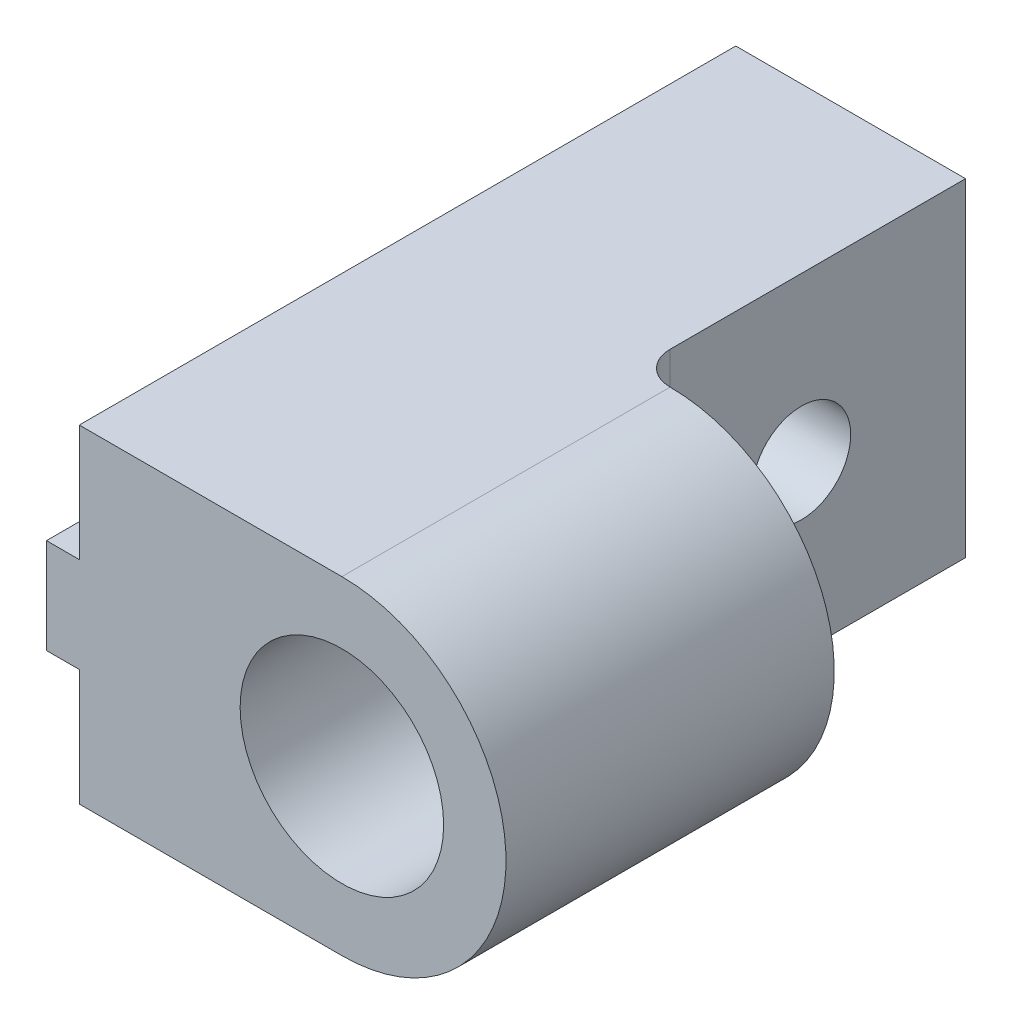
ISO-10303-21;
HEADER;
FILE_DESCRIPTION(('STEP AP214'),'2;1');
FILE_NAME('part.step','',(''),(''),'','','');
FILE_SCHEMA(('AUTOMOTIVE_DESIGN { 1 0 10303 214 1 1 1 1 }'));
ENDSEC;
DATA;
#1=APPLICATION_CONTEXT('core data for automotive mechanical design processes');
#2=APPLICATION_PROTOCOL_DEFINITION('international standard','automotive_design',2000,#1);
#3=PRODUCT_CONTEXT('',#1,'mechanical');
#4=PRODUCT('Part','Part','',(#3));
#5=PRODUCT_RELATED_PRODUCT_CATEGORY('part','',(#4));
#6=PRODUCT_DEFINITION_FORMATION('','',#4);
#7=PRODUCT_DEFINITION_CONTEXT('part definition',#1,'design');
#8=PRODUCT_DEFINITION('design','',#6,#7);
#9=PRODUCT_DEFINITION_SHAPE('','',#8);
#10=(LENGTH_UNIT() NAMED_UNIT(*) SI_UNIT(.MILLI.,.METRE.));
#11=(NAMED_UNIT(*) PLANE_ANGLE_UNIT() SI_UNIT($,.RADIAN.));
#12=(NAMED_UNIT(*) SI_UNIT($,.STERADIAN.) SOLID_ANGLE_UNIT());
#13=UNCERTAINTY_MEASURE_WITH_UNIT(LENGTH_MEASURE(1.E-05),#10,'distance_accuracy_value','');
#14=(GEOMETRIC_REPRESENTATION_CONTEXT(3) GLOBAL_UNCERTAINTY_ASSIGNED_CONTEXT((#13)) GLOBAL_UNIT_ASSIGNED_CONTEXT((#10,
#11,#12)) REPRESENTATION_CONTEXT('',''));
#15=CARTESIAN_POINT('',(0.,0.,0.));
#16=DIRECTION('',(0.,0.,1.));
#17=DIRECTION('',(1.,0.,0.));
#18=AXIS2_PLACEMENT_3D('',#15,#16,#17);
#19=CARTESIAN_POINT('',(-8.,1.45,20.));
#20=DIRECTION('',(0.,-1.,0.));
#21=DIRECTION('',(1.,0.,0.));
#22=AXIS2_PLACEMENT_3D('',#19,#20,#21);
#23=PLANE('',#22);
#24=DIRECTION('',(0.,0.,-1.));
#25=VECTOR('',#24,1.);
#26=CARTESIAN_POINT('',(-9.,1.45,20.));
#27=LINE('',#26,#25);
#28=CARTESIAN_POINT('',(-9.,1.45,4.61594271260656));
#29=VERTEX_POINT('',#28);
#30=CARTESIAN_POINT('',(-9.,1.45,0.));
#31=VERTEX_POINT('',#30);
#32=EDGE_CURVE('E151',#29,#31,#27,.T.);
#33=ORIENTED_EDGE('',*,*,#32,.F.);
#34=DIRECTION('',(1.,0.,0.));
#35=VECTOR('',#34,1.);
#36=CARTESIAN_POINT('',(-9.,1.45,4.61594271260656));
#37=LINE('',#36,#35);
#38=CARTESIAN_POINT('',(-8.,1.45,4.61594271260655));
#39=VERTEX_POINT('',#38);
#40=EDGE_CURVE('E135',#29,#39,#37,.T.);
#41=ORIENTED_EDGE('',*,*,#40,.T.);
#42=DIRECTION('',(0.,0.,-1.));
#43=VECTOR('',#42,1.);
#44=CARTESIAN_POINT('',(-8.,1.45,20.));
#45=LINE('',#44,#43);
#46=CARTESIAN_POINT('',(-8.,1.45,0.));
#47=VERTEX_POINT('',#46);
#48=EDGE_CURVE('E164',#39,#47,#45,.T.);
#49=ORIENTED_EDGE('',*,*,#48,.T.);
#50=DIRECTION('',(-1.,0.,0.));
#51=VECTOR('',#50,1.);
#52=CARTESIAN_POINT('',(-8.,1.45,0.));
#53=LINE('',#52,#51);
#54=EDGE_CURVE('E158',#47,#31,#53,.T.);
#55=ORIENTED_EDGE('',*,*,#54,.T.);
#56=EDGE_LOOP('',(#33,#41,#49,#55));
#57=FACE_BOUND('',#56,.T.);
#58=ADVANCED_FACE('F35',(#57),#23,.F.);
#59=CARTESIAN_POINT('',(-9.,1.45,20.));
#60=DIRECTION('',(1.,0.,0.));
#61=DIRECTION('',(0.,0.,-1.));
#62=AXIS2_PLACEMENT_3D('',#59,#60,#61);
#63=PLANE('',#62);
#64=CARTESIAN_POINT('',(-9.,1.45,20.));
#65=VERTEX_POINT('',#64);
#66=CARTESIAN_POINT('',(-9.,1.45,5.38405728739344));
#67=VERTEX_POINT('',#66);
#68=EDGE_CURVE('E160',#65,#67,#27,.T.);
#69=ORIENTED_EDGE('',*,*,#68,.T.);
#70=CARTESIAN_POINT('',(-9.,0.,5.));
#71=DIRECTION('',(1.,0.,0.));
#72=DIRECTION('',(0.,0.,-1.));
#73=AXIS2_PLACEMENT_3D('',#70,#71,#72);
#74=CIRCLE('',#73,1.5);
#75=CARTESIAN_POINT('',(-9.,-1.45,5.38405728739343));
#76=VERTEX_POINT('',#75);
#77=EDGE_CURVE('E154',#67,#76,#74,.T.);
#78=ORIENTED_EDGE('',*,*,#77,.T.);
#79=DIRECTION('',(0.,0.,-1.));
#80=VECTOR('',#79,1.);
#81=CARTESIAN_POINT('',(-9.,-1.45,20.));
#82=LINE('',#81,#80);
#83=CARTESIAN_POINT('',(-9.,-1.45,20.));
#84=VERTEX_POINT('',#83);
#85=EDGE_CURVE('E161',#84,#76,#82,.T.);
#86=ORIENTED_EDGE('',*,*,#85,.F.);
#87=DIRECTION('',(0.,-1.,0.));
#88=VECTOR('',#87,1.);
#89=CARTESIAN_POINT('',(-9.,1.45,20.));
#90=LINE('',#89,#88);
#91=EDGE_CURVE('E225',#65,#84,#90,.T.);
#92=ORIENTED_EDGE('',*,*,#91,.F.);
#93=EDGE_LOOP('',(#69,#78,#86,#92));
#94=FACE_BOUND('',#93,.T.);
#95=ADVANCED_FACE('F302',(#94),#63,.F.);
#96=CARTESIAN_POINT('',(-9.,-1.45,20.));
#97=DIRECTION('',(0.,1.,0.));
#98=DIRECTION('',(-1.,0.,0.));
#99=AXIS2_PLACEMENT_3D('',#96,#97,#98);
#100=PLANE('',#99);
#101=ORIENTED_EDGE('',*,*,#85,.T.);
#102=DIRECTION('',(1.,0.,0.));
#103=VECTOR('',#102,1.);
#104=CARTESIAN_POINT('',(-9.,-1.45,5.38405728739343));
#105=LINE('',#104,#103);
#106=CARTESIAN_POINT('',(-8.,-1.45,5.38405728739343));
#107=VERTEX_POINT('',#106);
#108=EDGE_CURVE('E275',#76,#107,#105,.T.);
#109=ORIENTED_EDGE('',*,*,#108,.T.);
#110=DIRECTION('',(0.,0.,-1.));
#111=VECTOR('',#110,1.);
#112=CARTESIAN_POINT('',(-8.,-1.45,20.));
#113=LINE('',#112,#111);
#114=CARTESIAN_POINT('',(-8.,-1.45,20.));
#115=VERTEX_POINT('',#114);
#116=EDGE_CURVE('E250',#115,#107,#113,.T.);
#117=ORIENTED_EDGE('',*,*,#116,.F.);
#118=DIRECTION('',(1.,0.,0.));
#119=VECTOR('',#118,1.);
#120=CARTESIAN_POINT('',(-9.,-1.45,20.));
#121=LINE('',#120,#119);
#122=EDGE_CURVE('E227',#84,#115,#121,.T.);
#123=ORIENTED_EDGE('',*,*,#122,.F.);
#124=EDGE_LOOP('',(#101,#109,#117,#123));
#125=FACE_BOUND('',#124,.T.);
#126=ADVANCED_FACE('F274',(#125),#100,.F.);
#127=CARTESIAN_POINT('',(-8.,5.,20.));
#128=DIRECTION('',(0.,-1.,0.));
#129=DIRECTION('',(0.,0.,-1.));
#130=AXIS2_PLACEMENT_3D('',#127,#128,#129);
#131=PLANE('',#130);
#132=DIRECTION('',(0.,0.,-1.));
#133=VECTOR('',#132,1.);
#134=CARTESIAN_POINT('',(0.,5.,20.));
#135=LINE('',#134,#133);
#136=CARTESIAN_POINT('',(0.,5.,20.));
#137=VERTEX_POINT('',#136);
#138=CARTESIAN_POINT('',(0.,5.,10.));
#139=VERTEX_POINT('',#138);
#140=EDGE_CURVE('E198',#137,#139,#135,.T.);
#141=ORIENTED_EDGE('',*,*,#140,.T.);
#142=CARTESIAN_POINT('',(0.,5.,9.));
#143=DIRECTION('',(0.,-1.,0.));
#144=DIRECTION('',(0.,0.,-1.));
#145=AXIS2_PLACEMENT_3D('',#142,#143,#144);
#146=CIRCLE('',#145,1.);
#147=CARTESIAN_POINT('',(-0.999999999999997,5.,9.));
#148=VERTEX_POINT('',#147);
#149=EDGE_CURVE('E11',#139,#148,#146,.T.);
#150=ORIENTED_EDGE('',*,*,#149,.T.);
#151=DIRECTION('',(0.,0.,1.));
#152=VECTOR('',#151,1.);
#153=CARTESIAN_POINT('',(-0.999999999999997,5.,10.));
#154=LINE('',#153,#152);
#155=CARTESIAN_POINT('',(-0.999999999999997,5.,0.));
#156=VERTEX_POINT('',#155);
#157=EDGE_CURVE('E203',#156,#148,#154,.T.);
#158=ORIENTED_EDGE('',*,*,#157,.F.);
#159=DIRECTION('',(-1.,0.,0.));
#160=VECTOR('',#159,1.);
#161=CARTESIAN_POINT('',(-8.,5.,0.));
#162=LINE('',#161,#160);
#163=CARTESIAN_POINT('',(-8.,5.,0.));
#164=VERTEX_POINT('',#163);
#165=EDGE_CURVE('E215',#156,#164,#162,.T.);
#166=ORIENTED_EDGE('',*,*,#165,.T.);
#167=DIRECTION('',(0.,0.,-1.));
#168=VECTOR('',#167,1.);
#169=CARTESIAN_POINT('',(-8.,5.,20.));
#170=LINE('',#169,#168);
#171=CARTESIAN_POINT('',(-8.,5.,20.));
#172=VERTEX_POINT('',#171);
#173=EDGE_CURVE('E172',#172,#164,#170,.T.);
#174=ORIENTED_EDGE('',*,*,#173,.F.);
#175=DIRECTION('',(-1.,0.,0.));
#176=VECTOR('',#175,1.);
#177=CARTESIAN_POINT('',(-8.,5.,20.));
#178=LINE('',#177,#176);
#179=EDGE_CURVE('E217',#137,#172,#178,.T.);
#180=ORIENTED_EDGE('',*,*,#179,.F.);
#181=EDGE_LOOP('',(#141,#150,#158,#166,#174,#180));
#182=FACE_BOUND('',#181,.T.);
#183=ADVANCED_FACE('F295',(#182),#131,.F.);
#184=CARTESIAN_POINT('',(-8.,-5.,20.));
#185=DIRECTION('',(0.,1.,0.));
#186=DIRECTION('',(0.,0.,1.));
#187=AXIS2_PLACEMENT_3D('',#184,#185,#186);
#188=PLANE('',#187);
#189=DIRECTION('',(0.,0.,-1.));
#190=VECTOR('',#189,1.);
#191=CARTESIAN_POINT('',(-1.,-5.,10.));
#192=LINE('',#191,#190);
#193=CARTESIAN_POINT('',(-1.,-5.,9.));
#194=VERTEX_POINT('',#193);
#195=CARTESIAN_POINT('',(-0.999999999999999,-5.,0.));
#196=VERTEX_POINT('',#195);
#197=EDGE_CURVE('E145',#194,#196,#192,.T.);
#198=ORIENTED_EDGE('',*,*,#197,.F.);
#199=CARTESIAN_POINT('',(0.,-5.,9.));
#200=DIRECTION('',(0.,1.,0.));
#201=DIRECTION('',(0.,0.,1.));
#202=AXIS2_PLACEMENT_3D('',#199,#200,#201);
#203=CIRCLE('',#202,1.);
#204=CARTESIAN_POINT('',(0.,-5.,10.));
#205=VERTEX_POINT('',#204);
#206=EDGE_CURVE('E43',#194,#205,#203,.T.);
#207=ORIENTED_EDGE('',*,*,#206,.T.);
#208=DIRECTION('',(0.,0.,-1.));
#209=VECTOR('',#208,1.);
#210=CARTESIAN_POINT('',(0.,-5.,20.));
#211=LINE('',#210,#209);
#212=CARTESIAN_POINT('',(0.,-5.,20.));
#213=VERTEX_POINT('',#212);
#214=EDGE_CURVE('E187',#213,#205,#211,.T.);
#215=ORIENTED_EDGE('',*,*,#214,.F.);
#216=DIRECTION('',(1.,0.,0.));
#217=VECTOR('',#216,1.);
#218=CARTESIAN_POINT('',(-8.,-5.,20.));
#219=LINE('',#218,#217);
#220=CARTESIAN_POINT('',(-8.,-5.,20.));
#221=VERTEX_POINT('',#220);
#222=EDGE_CURVE('E231',#221,#213,#219,.T.);
#223=ORIENTED_EDGE('',*,*,#222,.F.);
#224=DIRECTION('',(0.,0.,-1.));
#225=VECTOR('',#224,1.);
#226=CARTESIAN_POINT('',(-8.,-5.,20.));
#227=LINE('',#226,#225);
#228=CARTESIAN_POINT('',(-8.,-5.,0.));
#229=VERTEX_POINT('',#228);
#230=EDGE_CURVE('E197',#221,#229,#227,.T.);
#231=ORIENTED_EDGE('',*,*,#230,.T.);
#232=DIRECTION('',(1.,0.,0.));
#233=VECTOR('',#232,1.);
#234=CARTESIAN_POINT('',(-8.,-5.,0.));
#235=LINE('',#234,#233);
#236=EDGE_CURVE('E221',#229,#196,#235,.T.);
#237=ORIENTED_EDGE('',*,*,#236,.T.);
#238=EDGE_LOOP('',(#198,#207,#215,#223,#231,#237));
#239=FACE_BOUND('',#238,.T.);
#240=ADVANCED_FACE('F184',(#239),#188,.F.);
#241=CARTESIAN_POINT('',(0.,0.,20.));
#242=DIRECTION('',(0.,0.,-1.));
#243=DIRECTION('',(-1.,0.,0.));
#244=AXIS2_PLACEMENT_3D('',#241,#242,#243);
#245=CYLINDRICAL_SURFACE('',#244,5.);
#246=CARTESIAN_POINT('',(0.,0.,10.));
#247=DIRECTION('',(0.,0.,-1.));
#248=DIRECTION('',(0.,1.,0.));
#249=AXIS2_PLACEMENT_3D('',#246,#247,#248);
#250=CIRCLE('',#249,5.);
#251=EDGE_CURVE('E175',#139,#205,#250,.T.);
#252=ORIENTED_EDGE('',*,*,#251,.F.);
#253=ORIENTED_EDGE('',*,*,#140,.F.);
#254=CARTESIAN_POINT('',(0.,0.,20.));
#255=DIRECTION('',(0.,0.,1.));
#256=DIRECTION('',(1.,0.,0.));
#257=AXIS2_PLACEMENT_3D('',#254,#255,#256);
#258=CIRCLE('',#257,5.);
#259=EDGE_CURVE('E196',#213,#137,#258,.T.);
#260=ORIENTED_EDGE('',*,*,#259,.F.);
#261=ORIENTED_EDGE('',*,*,#214,.T.);
#262=EDGE_LOOP('',(#252,#253,#260,#261));
#263=FACE_BOUND('',#262,.T.);
#264=ADVANCED_FACE('F195',(#263),#245,.T.);
#265=CARTESIAN_POINT('',(0.,0.,0.));
#266=DIRECTION('',(0.,0.,1.));
#267=DIRECTION('',(1.,0.,0.));
#268=AXIS2_PLACEMENT_3D('',#265,#266,#267);
#269=PLANE('',#268);
#270=DIRECTION('',(0.,1.,0.));
#271=VECTOR('',#270,1.);
#272=CARTESIAN_POINT('',(-0.999999999999997,5.,0.));
#273=LINE('',#272,#271);
#274=EDGE_CURVE('E204',#196,#156,#273,.T.);
#275=ORIENTED_EDGE('',*,*,#274,.F.);
#276=ORIENTED_EDGE('',*,*,#236,.F.);
#277=DIRECTION('',(0.,-1.,0.));
#278=VECTOR('',#277,1.);
#279=CARTESIAN_POINT('',(-8.,-1.45,0.));
#280=LINE('',#279,#278);
#281=CARTESIAN_POINT('',(-8.,-1.45,0.));
#282=VERTEX_POINT('',#281);
#283=EDGE_CURVE('E244',#282,#229,#280,.T.);
#284=ORIENTED_EDGE('',*,*,#283,.F.);
#285=DIRECTION('',(1.,0.,0.));
#286=VECTOR('',#285,1.);
#287=CARTESIAN_POINT('',(-9.,-1.45,0.));
#288=LINE('',#287,#286);
#289=CARTESIAN_POINT('',(-9.,-1.45,0.));
#290=VERTEX_POINT('',#289);
#291=EDGE_CURVE('E241',#290,#282,#288,.T.);
#292=ORIENTED_EDGE('',*,*,#291,.F.);
#293=DIRECTION('',(0.,-1.,0.));
#294=VECTOR('',#293,1.);
#295=CARTESIAN_POINT('',(-9.,1.45,0.));
#296=LINE('',#295,#294);
#297=EDGE_CURVE('E239',#31,#290,#296,.T.);
#298=ORIENTED_EDGE('',*,*,#297,.F.);
#299=ORIENTED_EDGE('',*,*,#54,.F.);
#300=DIRECTION('',(0.,-1.,0.));
#301=VECTOR('',#300,1.);
#302=CARTESIAN_POINT('',(-8.,5.,0.));
#303=LINE('',#302,#301);
#304=EDGE_CURVE('E235',#164,#47,#303,.T.);
#305=ORIENTED_EDGE('',*,*,#304,.F.);
#306=ORIENTED_EDGE('',*,*,#165,.F.);
#307=EDGE_LOOP('',(#275,#276,#284,#292,#298,#299,#305,#306));
#308=FACE_BOUND('',#307,.T.);
#309=ADVANCED_FACE('F266',(#308),#269,.F.);
#310=CARTESIAN_POINT('',(-8.,5.,20.));
#311=DIRECTION('',(1.,0.,0.));
#312=DIRECTION('',(0.,1.,0.));
#313=AXIS2_PLACEMENT_3D('',#310,#311,#312);
#314=PLANE('',#313);
#315=ORIENTED_EDGE('',*,*,#48,.F.);
#316=CARTESIAN_POINT('',(-8.,0.,5.));
#317=DIRECTION('',(1.,0.,0.));
#318=DIRECTION('',(0.,1.,0.));
#319=AXIS2_PLACEMENT_3D('',#316,#317,#318);
#320=CIRCLE('',#319,1.5);
#321=CARTESIAN_POINT('',(-8.,1.45,5.38405728739344));
#322=VERTEX_POINT('',#321);
#323=EDGE_CURVE('E141',#39,#322,#320,.T.);
#324=ORIENTED_EDGE('',*,*,#323,.T.);
#325=CARTESIAN_POINT('',(-8.,1.45,20.));
#326=VERTEX_POINT('',#325);
#327=EDGE_CURVE('E169',#326,#322,#45,.T.);
#328=ORIENTED_EDGE('',*,*,#327,.F.);
#329=DIRECTION('',(0.,-1.,0.));
#330=VECTOR('',#329,1.);
#331=CARTESIAN_POINT('',(-8.,5.,20.));
#332=LINE('',#331,#330);
#333=EDGE_CURVE('E220',#172,#326,#332,.T.);
#334=ORIENTED_EDGE('',*,*,#333,.F.);
#335=ORIENTED_EDGE('',*,*,#173,.T.);
#336=ORIENTED_EDGE('',*,*,#304,.T.);
#337=EDGE_LOOP('',(#315,#324,#328,#334,#335,#336));
#338=FACE_BOUND('',#337,.T.);
#339=ADVANCED_FACE('F287',(#338),#314,.F.);
#340=ORIENTED_EDGE('',*,*,#327,.T.);
#341=DIRECTION('',(1.,0.,0.));
#342=VECTOR('',#341,1.);
#343=CARTESIAN_POINT('',(-9.,1.45,5.38405728739344));
#344=LINE('',#343,#342);
#345=EDGE_CURVE('E277',#322,#67,#344,.F.);
#346=ORIENTED_EDGE('',*,*,#345,.T.);
#347=ORIENTED_EDGE('',*,*,#68,.F.);
#348=DIRECTION('',(-1.,0.,0.));
#349=VECTOR('',#348,1.);
#350=CARTESIAN_POINT('',(-8.,1.45,20.));
#351=LINE('',#350,#349);
#352=EDGE_CURVE('E223',#326,#65,#351,.T.);
#353=ORIENTED_EDGE('',*,*,#352,.F.);
#354=EDGE_LOOP('',(#340,#346,#347,#353));
#355=FACE_BOUND('',#354,.T.);
#356=ADVANCED_FACE('F290',(#355),#23,.F.);
#357=CARTESIAN_POINT('',(-9.,-1.45,4.61594271260657));
#358=VERTEX_POINT('',#357);
#359=EDGE_CURVE('E153',#358,#290,#82,.T.);
#360=ORIENTED_EDGE('',*,*,#359,.F.);
#361=EDGE_CURVE('E138',#358,#29,#74,.T.);
#362=ORIENTED_EDGE('',*,*,#361,.T.);
#363=ORIENTED_EDGE('',*,*,#32,.T.);
#364=ORIENTED_EDGE('',*,*,#297,.T.);
#365=EDGE_LOOP('',(#360,#362,#363,#364));
#366=FACE_BOUND('',#365,.T.);
#367=ADVANCED_FACE('F149',(#366),#63,.F.);
#368=CARTESIAN_POINT('',(-8.,-1.45,4.61594271260657));
#369=VERTEX_POINT('',#368);
#370=EDGE_CURVE('E249',#369,#282,#113,.T.);
#371=ORIENTED_EDGE('',*,*,#370,.F.);
#372=DIRECTION('',(1.,0.,0.));
#373=VECTOR('',#372,1.);
#374=CARTESIAN_POINT('',(-9.,-1.45,4.61594271260657));
#375=LINE('',#374,#373);
#376=EDGE_CURVE('E278',#369,#358,#375,.F.);
#377=ORIENTED_EDGE('',*,*,#376,.T.);
#378=ORIENTED_EDGE('',*,*,#359,.T.);
#379=ORIENTED_EDGE('',*,*,#291,.T.);
#380=EDGE_LOOP('',(#371,#377,#378,#379));
#381=FACE_BOUND('',#380,.T.);
#382=ADVANCED_FACE('F263',(#381),#100,.F.);
#383=CARTESIAN_POINT('',(-8.,-1.45,20.));
#384=DIRECTION('',(1.,0.,0.));
#385=DIRECTION('',(0.,1.,0.));
#386=AXIS2_PLACEMENT_3D('',#383,#384,#385);
#387=PLANE('',#386);
#388=ORIENTED_EDGE('',*,*,#116,.T.);
#389=CARTESIAN_POINT('',(-8.,0.,5.));
#390=DIRECTION('',(1.,0.,0.));
#391=DIRECTION('',(0.,1.,0.));
#392=AXIS2_PLACEMENT_3D('',#389,#390,#391);
#393=CIRCLE('',#392,1.5);
#394=EDGE_CURVE('E260',#107,#369,#393,.T.);
#395=ORIENTED_EDGE('',*,*,#394,.T.);
#396=ORIENTED_EDGE('',*,*,#370,.T.);
#397=ORIENTED_EDGE('',*,*,#283,.T.);
#398=ORIENTED_EDGE('',*,*,#230,.F.);
#399=DIRECTION('',(0.,-1.,0.));
#400=VECTOR('',#399,1.);
#401=CARTESIAN_POINT('',(-8.,-1.45,20.));
#402=LINE('',#401,#400);
#403=EDGE_CURVE('E229',#115,#221,#402,.T.);
#404=ORIENTED_EDGE('',*,*,#403,.F.);
#405=EDGE_LOOP('',(#388,#395,#396,#397,#398,#404));
#406=FACE_BOUND('',#405,.T.);
#407=ADVANCED_FACE('F257',(#406),#387,.F.);
#408=CARTESIAN_POINT('',(0.,0.,20.));
#409=DIRECTION('',(0.,0.,1.));
#410=DIRECTION('',(1.,0.,0.));
#411=AXIS2_PLACEMENT_3D('',#408,#409,#410);
#412=PLANE('',#411);
#413=CARTESIAN_POINT('',(0.,0.,20.));
#414=DIRECTION('',(0.,0.,1.));
#415=DIRECTION('',(1.,0.,0.));
#416=AXIS2_PLACEMENT_3D('',#413,#414,#415);
#417=CIRCLE('',#416,3.1);
#418=CARTESIAN_POINT('',(3.1,0.,20.));
#419=VERTEX_POINT('',#418);
#420=EDGE_CURVE('E206',#419,#419,#417,.T.);
#421=ORIENTED_EDGE('',*,*,#420,.F.);
#422=EDGE_LOOP('',(#421));
#423=FACE_BOUND('',#422,.T.);
#424=ORIENTED_EDGE('',*,*,#179,.T.);
#425=ORIENTED_EDGE('',*,*,#333,.T.);
#426=ORIENTED_EDGE('',*,*,#352,.T.);
#427=ORIENTED_EDGE('',*,*,#91,.T.);
#428=ORIENTED_EDGE('',*,*,#122,.T.);
#429=ORIENTED_EDGE('',*,*,#403,.T.);
#430=ORIENTED_EDGE('',*,*,#222,.T.);
#431=ORIENTED_EDGE('',*,*,#259,.T.);
#432=EDGE_LOOP('',(#424,#425,#426,#427,#428,#429,#430,#431));
#433=FACE_BOUND('',#432,.T.);
#434=ADVANCED_FACE('F268',(#423,#433),#412,.T.);
#435=CARTESIAN_POINT('',(0.,0.,15.));
#436=DIRECTION('',(0.,0.,1.));
#437=DIRECTION('',(1.,0.,0.));
#438=AXIS2_PLACEMENT_3D('',#435,#436,#437);
#439=CYLINDRICAL_SURFACE('',#438,3.1);
#440=CARTESIAN_POINT('',(0.,0.,15.));
#441=DIRECTION('',(0.,0.,1.));
#442=DIRECTION('',(1.,0.,0.));
#443=AXIS2_PLACEMENT_3D('',#440,#441,#442);
#444=CIRCLE('',#443,3.1);
#445=CARTESIAN_POINT('',(3.1,0.,15.));
#446=VERTEX_POINT('',#445);
#447=EDGE_CURVE('E209',#446,#446,#444,.T.);
#448=ORIENTED_EDGE('',*,*,#447,.F.);
#449=EDGE_LOOP('',(#448));
#450=FACE_BOUND('',#449,.T.);
#451=ORIENTED_EDGE('',*,*,#420,.T.);
#452=EDGE_LOOP('',(#451));
#453=FACE_BOUND('',#452,.T.);
#454=ADVANCED_FACE('F345',(#450,#453),#439,.F.);
#455=CARTESIAN_POINT('',(0.,0.,15.));
#456=DIRECTION('',(0.,0.,1.));
#457=DIRECTION('',(1.,0.,0.));
#458=AXIS2_PLACEMENT_3D('',#455,#456,#457);
#459=PLANE('',#458);
#460=ORIENTED_EDGE('',*,*,#447,.T.);
#461=EDGE_LOOP('',(#460));
#462=FACE_BOUND('',#461,.T.);
#463=ADVANCED_FACE('F352',(#462),#459,.T.);
#464=CARTESIAN_POINT('',(5.,5.,10.));
#465=DIRECTION('',(0.,0.,-1.));
#466=DIRECTION('',(0.,1.,0.));
#467=AXIS2_PLACEMENT_3D('',#464,#465,#466);
#468=PLANE('',#467);
#469=ORIENTED_EDGE('',*,*,#251,.T.);
#470=DIRECTION('',(0.,-1.,0.));
#471=VECTOR('',#470,1.);
#472=CARTESIAN_POINT('',(0.,5.,10.));
#473=LINE('',#472,#471);
#474=EDGE_CURVE('E180',#205,#139,#473,.F.);
#475=ORIENTED_EDGE('',*,*,#474,.T.);
#476=EDGE_LOOP('',(#469,#475));
#477=FACE_BOUND('',#476,.T.);
#478=ADVANCED_FACE('F192',(#477),#468,.T.);
#479=CARTESIAN_POINT('',(-0.999999999999999,0.,0.));
#480=DIRECTION('',(1.,0.,0.));
#481=DIRECTION('',(0.,1.,0.));
#482=AXIS2_PLACEMENT_3D('',#479,#480,#481);
#483=PLANE('',#482);
#484=CARTESIAN_POINT('',(-0.999999999999999,0.,5.));
#485=DIRECTION('',(1.,0.,0.));
#486=DIRECTION('',(0.,0.,-1.));
#487=AXIS2_PLACEMENT_3D('',#484,#485,#486);
#488=CIRCLE('',#487,1.5);
#489=CARTESIAN_POINT('',(-0.999999999999999,0.,3.5));
#490=VERTEX_POINT('',#489);
#491=EDGE_CURVE('E155',#490,#490,#488,.T.);
#492=ORIENTED_EDGE('',*,*,#491,.F.);
#493=EDGE_LOOP('',(#492));
#494=FACE_BOUND('',#493,.T.);
#495=ORIENTED_EDGE('',*,*,#157,.T.);
#496=DIRECTION('',(0.,-1.,0.));
#497=VECTOR('',#496,1.);
#498=CARTESIAN_POINT('',(-1.,-5.,9.));
#499=LINE('',#498,#497);
#500=EDGE_CURVE('E178',#148,#194,#499,.T.);
#501=ORIENTED_EDGE('',*,*,#500,.T.);
#502=ORIENTED_EDGE('',*,*,#197,.T.);
#503=ORIENTED_EDGE('',*,*,#274,.T.);
#504=EDGE_LOOP('',(#495,#501,#502,#503));
#505=FACE_BOUND('',#504,.T.);
#506=ADVANCED_FACE('F201',(#494,#505),#483,.T.);
#507=CARTESIAN_POINT('',(-9.,0.,5.));
#508=DIRECTION('',(1.,0.,0.));
#509=DIRECTION('',(0.,0.,-1.));
#510=AXIS2_PLACEMENT_3D('',#507,#508,#509);
#511=CYLINDRICAL_SURFACE('',#510,1.5);
#512=ORIENTED_EDGE('',*,*,#491,.T.);
#513=EDGE_LOOP('',(#512));
#514=FACE_BOUND('',#513,.T.);
#515=ORIENTED_EDGE('',*,*,#361,.F.);
#516=ORIENTED_EDGE('',*,*,#376,.F.);
#517=ORIENTED_EDGE('',*,*,#394,.F.);
#518=ORIENTED_EDGE('',*,*,#108,.F.);
#519=ORIENTED_EDGE('',*,*,#77,.F.);
#520=ORIENTED_EDGE('',*,*,#345,.F.);
#521=ORIENTED_EDGE('',*,*,#323,.F.);
#522=ORIENTED_EDGE('',*,*,#40,.F.);
#523=EDGE_LOOP('',(#515,#516,#517,#518,#519,#520,#521,#522));
#524=FACE_BOUND('',#523,.T.);
#525=ADVANCED_FACE('F137',(#514,#524),#511,.F.);
#526=CARTESIAN_POINT('',(0.,0.,9.));
#527=DIRECTION('',(0.,1.,0.));
#528=DIRECTION('',(-1.,0.,0.));
#529=AXIS2_PLACEMENT_3D('',#526,#527,#528);
#530=CYLINDRICAL_SURFACE('',#529,1.);
#531=ORIENTED_EDGE('',*,*,#149,.F.);
#532=ORIENTED_EDGE('',*,*,#474,.F.);
#533=ORIENTED_EDGE('',*,*,#206,.F.);
#534=ORIENTED_EDGE('',*,*,#500,.F.);
#535=EDGE_LOOP('',(#531,#532,#533,#534));
#536=FACE_BOUND('',#535,.T.);
#537=ADVANCED_FACE('F37',(#536),#530,.F.);
#538=CLOSED_SHELL('',(#58,#95,#126,#183,#240,#264,#309,#339,#356,#367,#382,#407,#434,#454,#463,
#478,#506,#525,#537));
#539=MANIFOLD_SOLID_BREP('B2',#538);
#540=ADVANCED_BREP_SHAPE_REPRESENTATION('',(#18,#539),#14);
#541=SHAPE_DEFINITION_REPRESENTATION(#9,#540);
ENDSEC;
END-ISO-10303-21;
